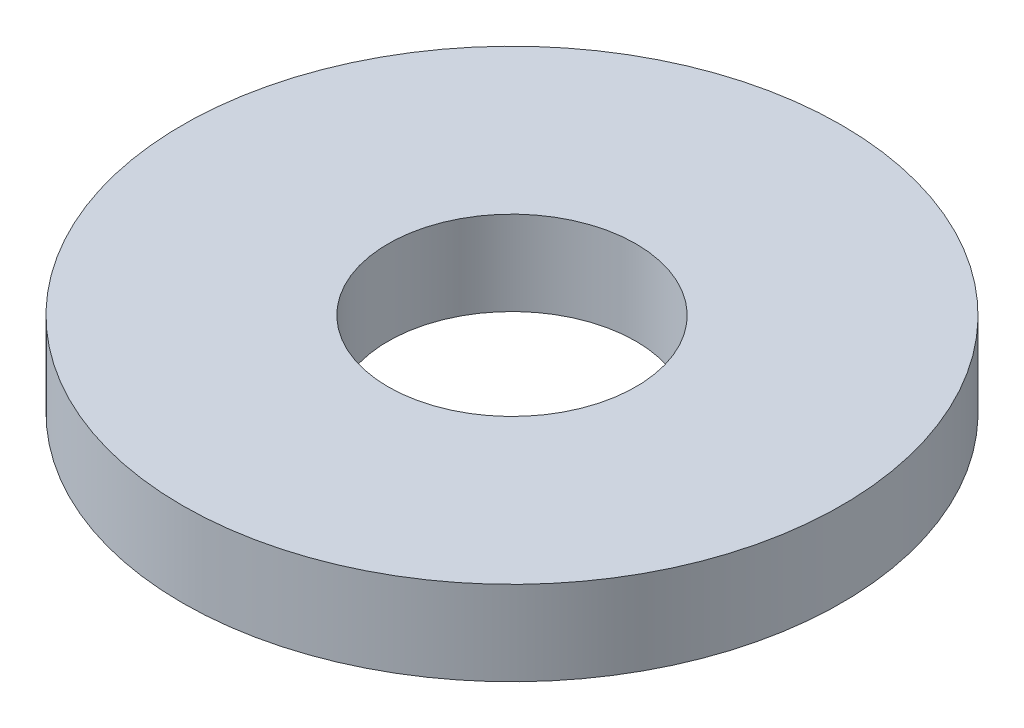
ISO-10303-21;
HEADER;
FILE_DESCRIPTION(('STEP AP214'),'2;1');
FILE_NAME('part.step','',(''),(''),'','','');
FILE_SCHEMA(('AUTOMOTIVE_DESIGN { 1 0 10303 214 1 1 1 1 }'));
ENDSEC;
DATA;
#1=APPLICATION_CONTEXT('core data for automotive mechanical design processes');
#2=APPLICATION_PROTOCOL_DEFINITION('international standard','automotive_design',2000,#1);
#3=PRODUCT_CONTEXT('',#1,'mechanical');
#4=PRODUCT('Part','Part','',(#3));
#5=PRODUCT_RELATED_PRODUCT_CATEGORY('part','',(#4));
#6=PRODUCT_DEFINITION_FORMATION('','',#4);
#7=PRODUCT_DEFINITION_CONTEXT('part definition',#1,'design');
#8=PRODUCT_DEFINITION('design','',#6,#7);
#9=PRODUCT_DEFINITION_SHAPE('','',#8);
#10=(LENGTH_UNIT() NAMED_UNIT(*) SI_UNIT(.MILLI.,.METRE.));
#11=(NAMED_UNIT(*) PLANE_ANGLE_UNIT() SI_UNIT($,.RADIAN.));
#12=(NAMED_UNIT(*) SI_UNIT($,.STERADIAN.) SOLID_ANGLE_UNIT());
#13=UNCERTAINTY_MEASURE_WITH_UNIT(LENGTH_MEASURE(1.E-05),#10,'distance_accuracy_value','');
#14=(GEOMETRIC_REPRESENTATION_CONTEXT(3) GLOBAL_UNCERTAINTY_ASSIGNED_CONTEXT((#13)) GLOBAL_UNIT_ASSIGNED_CONTEXT((#10,
#11,#12)) REPRESENTATION_CONTEXT('',''));
#15=CARTESIAN_POINT('',(0.,0.,0.));
#16=DIRECTION('',(0.,0.,1.));
#17=DIRECTION('',(1.,0.,0.));
#18=AXIS2_PLACEMENT_3D('',#15,#16,#17);
#19=CARTESIAN_POINT('',(0.,0.8128,0.));
#20=DIRECTION('',(0.,-1.,0.));
#21=DIRECTION('',(0.,0.,-1.));
#22=AXIS2_PLACEMENT_3D('',#19,#20,#21);
#23=CYLINDRICAL_SURFACE('',#22,3.175);
#24=CARTESIAN_POINT('',(0.,0.8128,0.));
#25=DIRECTION('',(0.,1.,0.));
#26=DIRECTION('',(0.,0.,1.));
#27=AXIS2_PLACEMENT_3D('',#24,#25,#26);
#28=CIRCLE('',#27,3.175);
#29=CARTESIAN_POINT('',(0.,0.8128,3.175));
#30=VERTEX_POINT('',#29);
#31=EDGE_CURVE('E10',#30,#30,#28,.T.);
#32=ORIENTED_EDGE('',*,*,#31,.F.);
#33=EDGE_LOOP('',(#32));
#34=FACE_BOUND('',#33,.T.);
#35=CARTESIAN_POINT('',(0.,0.,0.));
#36=DIRECTION('',(0.,1.,0.));
#37=DIRECTION('',(0.,0.,1.));
#38=AXIS2_PLACEMENT_3D('',#35,#36,#37);
#39=CIRCLE('',#38,3.175);
#40=CARTESIAN_POINT('',(0.,0.,3.175));
#41=VERTEX_POINT('',#40);
#42=EDGE_CURVE('E35',#41,#41,#39,.T.);
#43=ORIENTED_EDGE('',*,*,#42,.T.);
#44=EDGE_LOOP('',(#43));
#45=FACE_BOUND('',#44,.T.);
#46=ADVANCED_FACE('F32',(#34,#45),#23,.T.);
#47=CARTESIAN_POINT('',(0.,0.8128,0.));
#48=DIRECTION('',(0.,1.,0.));
#49=DIRECTION('',(0.,0.,1.));
#50=AXIS2_PLACEMENT_3D('',#47,#48,#49);
#51=PLANE('',#50);
#52=CARTESIAN_POINT('',(0.,0.8128,0.));
#53=DIRECTION('',(0.,1.,0.));
#54=DIRECTION('',(0.,0.,1.));
#55=AXIS2_PLACEMENT_3D('',#52,#53,#54);
#56=CIRCLE('',#55,1.1938);
#57=CARTESIAN_POINT('',(0.,0.8128,1.1938));
#58=VERTEX_POINT('',#57);
#59=EDGE_CURVE('E44',#58,#58,#56,.T.);
#60=ORIENTED_EDGE('',*,*,#59,.F.);
#61=EDGE_LOOP('',(#60));
#62=FACE_BOUND('',#61,.T.);
#63=ORIENTED_EDGE('',*,*,#31,.T.);
#64=EDGE_LOOP('',(#63));
#65=FACE_BOUND('',#64,.T.);
#66=ADVANCED_FACE('F59',(#62,#65),#51,.T.);
#67=CARTESIAN_POINT('',(0.,0.,0.));
#68=DIRECTION('',(0.,1.,0.));
#69=DIRECTION('',(0.,0.,1.));
#70=AXIS2_PLACEMENT_3D('',#67,#68,#69);
#71=PLANE('',#70);
#72=CARTESIAN_POINT('',(0.,0.,0.));
#73=DIRECTION('',(0.,1.,0.));
#74=DIRECTION('',(0.,0.,1.));
#75=AXIS2_PLACEMENT_3D('',#72,#73,#74);
#76=CIRCLE('',#75,1.1938);
#77=CARTESIAN_POINT('',(0.,0.,1.1938));
#78=VERTEX_POINT('',#77);
#79=EDGE_CURVE('E42',#78,#78,#76,.T.);
#80=ORIENTED_EDGE('',*,*,#79,.T.);
#81=EDGE_LOOP('',(#80));
#82=FACE_BOUND('',#81,.T.);
#83=ORIENTED_EDGE('',*,*,#42,.F.);
#84=EDGE_LOOP('',(#83));
#85=FACE_BOUND('',#84,.T.);
#86=ADVANCED_FACE('F50',(#82,#85),#71,.F.);
#87=CARTESIAN_POINT('',(0.,0.,0.));
#88=DIRECTION('',(0.,1.,0.));
#89=DIRECTION('',(0.,0.,1.));
#90=AXIS2_PLACEMENT_3D('',#87,#88,#89);
#91=CYLINDRICAL_SURFACE('',#90,1.1938);
#92=ORIENTED_EDGE('',*,*,#79,.F.);
#93=EDGE_LOOP('',(#92));
#94=FACE_BOUND('',#93,.T.);
#95=ORIENTED_EDGE('',*,*,#59,.T.);
#96=EDGE_LOOP('',(#95));
#97=FACE_BOUND('',#96,.T.);
#98=ADVANCED_FACE('F53',(#94,#97),#91,.F.);
#99=CLOSED_SHELL('',(#46,#66,#86,#98));
#100=MANIFOLD_SOLID_BREP('B2',#99);
#101=ADVANCED_BREP_SHAPE_REPRESENTATION('',(#18,#100),#14);
#102=SHAPE_DEFINITION_REPRESENTATION(#9,#101);
ENDSEC;
END-ISO-10303-21;
